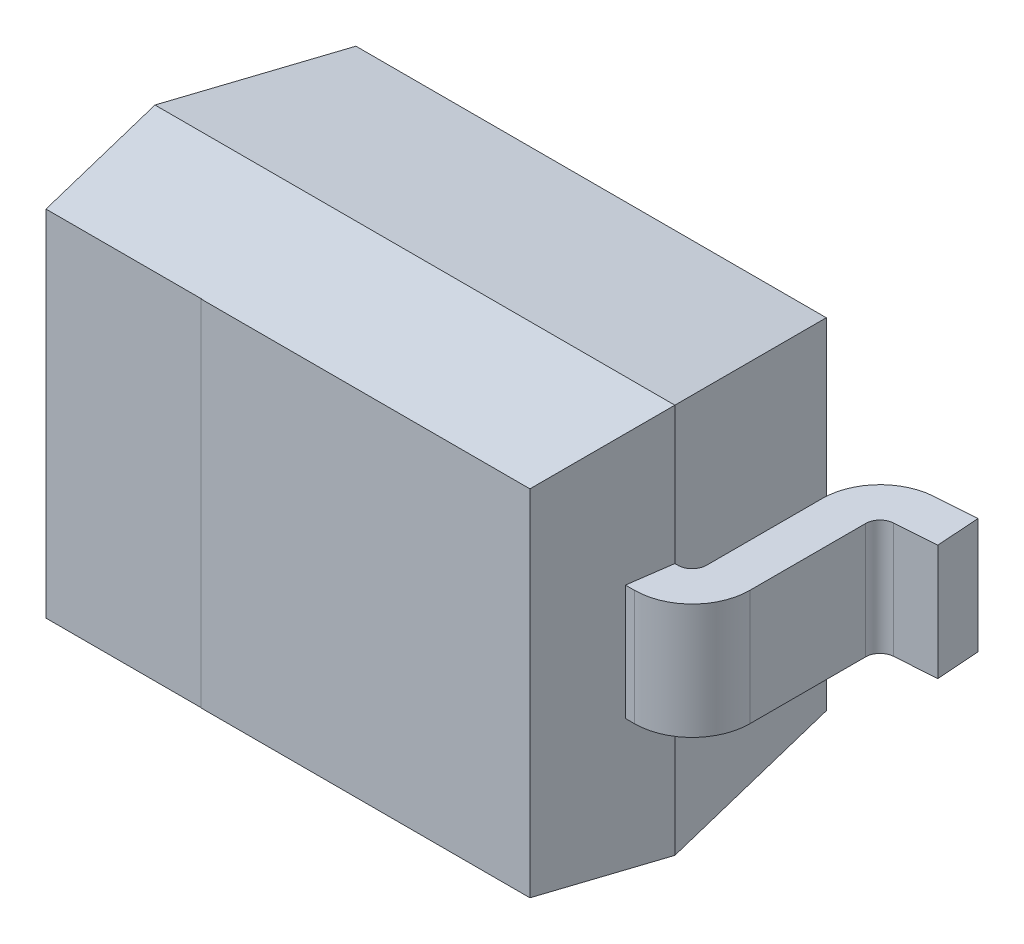
ISO-10303-21;
HEADER;
FILE_DESCRIPTION(('STEP AP214'),'2;1');
FILE_NAME('part.step','',(''),(''),'','','');
FILE_SCHEMA(('AUTOMOTIVE_DESIGN { 1 0 10303 214 1 1 1 1 }'));
ENDSEC;
DATA;
#1=APPLICATION_CONTEXT('core data for automotive mechanical design processes');
#2=APPLICATION_PROTOCOL_DEFINITION('international standard','automotive_design',2000,#1);
#3=PRODUCT_CONTEXT('',#1,'mechanical');
#4=PRODUCT('Part','Part','',(#3));
#5=PRODUCT_RELATED_PRODUCT_CATEGORY('part','',(#4));
#6=PRODUCT_DEFINITION_FORMATION('','',#4);
#7=PRODUCT_DEFINITION_CONTEXT('part definition',#1,'design');
#8=PRODUCT_DEFINITION('design','',#6,#7);
#9=PRODUCT_DEFINITION_SHAPE('','',#8);
#10=(LENGTH_UNIT() NAMED_UNIT(*) SI_UNIT(.MILLI.,.METRE.));
#11=(NAMED_UNIT(*) PLANE_ANGLE_UNIT() SI_UNIT($,.RADIAN.));
#12=(NAMED_UNIT(*) SI_UNIT($,.STERADIAN.) SOLID_ANGLE_UNIT());
#13=UNCERTAINTY_MEASURE_WITH_UNIT(LENGTH_MEASURE(1.E-05),#10,'distance_accuracy_value','');
#14=(GEOMETRIC_REPRESENTATION_CONTEXT(3) GLOBAL_UNCERTAINTY_ASSIGNED_CONTEXT((#13)) GLOBAL_UNIT_ASSIGNED_CONTEXT((#10,
#11,#12)) REPRESENTATION_CONTEXT('',''));
#15=CARTESIAN_POINT('',(0.,0.,0.));
#16=DIRECTION('',(0.,0.,1.));
#17=DIRECTION('',(1.,0.,0.));
#18=AXIS2_PLACEMENT_3D('',#15,#16,#17);
#19=CARTESIAN_POINT('',(0.838162032731,2.5,1.1));
#20=DIRECTION('',(-0.990268068741588,0.,-0.139173100959942));
#21=DIRECTION('',(-0.139173100959942,0.,0.990268068741588));
#22=AXIS2_PLACEMENT_3D('',#19,#20,#21);
#23=PLANE('',#22);
#24=DIRECTION('',(0.139173100959942,0.,-0.990268068741588));
#25=VECTOR('',#24,1.);
#26=CARTESIAN_POINT('',(0.878918874795,0.2,0.81));
#27=LINE('',#26,#25);
#28=CARTESIAN_POINT('',(0.878918874795,0.2,0.81));
#29=VERTEX_POINT('',#28);
#30=CARTESIAN_POINT('',(0.9,0.2,0.66));
#31=VERTEX_POINT('',#30);
#32=EDGE_CURVE('E11',#29,#31,#27,.T.);
#33=ORIENTED_EDGE('',*,*,#32,.T.);
#34=DIRECTION('',(0.,-1.,0.));
#35=VECTOR('',#34,1.);
#36=CARTESIAN_POINT('',(0.9,2.5,0.66));
#37=LINE('',#36,#35);
#38=CARTESIAN_POINT('',(0.9,0.675,0.66));
#39=VERTEX_POINT('',#38);
#40=EDGE_CURVE('E25',#39,#31,#37,.T.);
#41=ORIENTED_EDGE('',*,*,#40,.F.);
#42=DIRECTION('',(0.137844537491984,0.137844537491984,-0.980814848463889));
#43=VECTOR('',#42,1.);
#44=CARTESIAN_POINT('',(0.874014060794,0.649014060794,0.844899565031));
#45=LINE('',#44,#43);
#46=CARTESIAN_POINT('',(0.838162032731,0.613162032731,1.1));
#47=VERTEX_POINT('',#46);
#48=EDGE_CURVE('E689',#47,#39,#45,.T.);
#49=ORIENTED_EDGE('',*,*,#48,.F.);
#50=DIRECTION('',(0.,-1.,0.));
#51=VECTOR('',#50,1.);
#52=CARTESIAN_POINT('',(0.838162032731,2.5,1.1));
#53=LINE('',#52,#51);
#54=CARTESIAN_POINT('',(0.838162032731,-0.613162032731,1.1));
#55=VERTEX_POINT('',#54);
#56=EDGE_CURVE('E685',#47,#55,#53,.T.);
#57=ORIENTED_EDGE('',*,*,#56,.T.);
#58=DIRECTION('',(-0.137844537491984,0.137844537491984,0.980814848463889));
#59=VECTOR('',#58,1.);
#60=CARTESIAN_POINT('',(0.779008478213,-0.554008478213,1.520899410789));
#61=LINE('',#60,#59);
#62=CARTESIAN_POINT('',(0.9,-0.675,0.66));
#63=VERTEX_POINT('',#62);
#64=EDGE_CURVE('E240',#63,#55,#61,.T.);
#65=ORIENTED_EDGE('',*,*,#64,.F.);
#66=DIRECTION('',(0.,-1.,0.));
#67=VECTOR('',#66,1.);
#68=CARTESIAN_POINT('',(0.9,2.5,0.66));
#69=LINE('',#68,#67);
#70=CARTESIAN_POINT('',(0.9,-0.2,0.66));
#71=VERTEX_POINT('',#70);
#72=EDGE_CURVE('E677',#71,#63,#69,.T.);
#73=ORIENTED_EDGE('',*,*,#72,.F.);
#74=DIRECTION('',(0.139173100959942,0.,-0.990268068741588));
#75=VECTOR('',#74,1.);
#76=CARTESIAN_POINT('',(0.878918874795,-0.2,0.81));
#77=LINE('',#76,#75);
#78=CARTESIAN_POINT('',(0.878918874795,-0.2,0.81));
#79=VERTEX_POINT('',#78);
#80=EDGE_CURVE('E672',#79,#71,#77,.T.);
#81=ORIENTED_EDGE('',*,*,#80,.F.);
#82=DIRECTION('',(0.,-1.,0.));
#83=VECTOR('',#82,1.);
#84=CARTESIAN_POINT('',(0.878918874795,0.2,0.81));
#85=LINE('',#84,#83);
#86=EDGE_CURVE('E667',#29,#79,#85,.T.);
#87=ORIENTED_EDGE('',*,*,#86,.F.);
#88=EDGE_LOOP('',(#33,#41,#49,#57,#65,#73,#81,#87));
#89=FACE_BOUND('',#88,.T.);
#90=ADVANCED_FACE('F17',(#89),#23,.F.);
#91=CARTESIAN_POINT('',(0.91,0.2,0.81));
#92=DIRECTION('',(0.,0.,1.));
#93=DIRECTION('',(1.,0.,0.));
#94=AXIS2_PLACEMENT_3D('',#91,#92,#93);
#95=PLANE('',#94);
#96=DIRECTION('',(-1.,0.,0.));
#97=VECTOR('',#96,1.);
#98=CARTESIAN_POINT('',(0.91,-0.2,0.81));
#99=LINE('',#98,#97);
#100=CARTESIAN_POINT('',(0.91,-0.2,0.81));
#101=VERTEX_POINT('',#100);
#102=EDGE_CURVE('E662',#101,#79,#99,.T.);
#103=ORIENTED_EDGE('',*,*,#102,.F.);
#104=DIRECTION('',(0.,-1.,0.));
#105=VECTOR('',#104,1.);
#106=CARTESIAN_POINT('',(0.91,0.2,0.81));
#107=LINE('',#106,#105);
#108=CARTESIAN_POINT('',(0.91,0.2,0.81));
#109=VERTEX_POINT('',#108);
#110=EDGE_CURVE('E657',#109,#101,#107,.T.);
#111=ORIENTED_EDGE('',*,*,#110,.F.);
#112=DIRECTION('',(-1.,0.,0.));
#113=VECTOR('',#112,1.);
#114=CARTESIAN_POINT('',(0.91,0.2,0.81));
#115=LINE('',#114,#113);
#116=EDGE_CURVE('E652',#109,#29,#115,.T.);
#117=ORIENTED_EDGE('',*,*,#116,.T.);
#118=ORIENTED_EDGE('',*,*,#86,.T.);
#119=EDGE_LOOP('',(#103,#111,#117,#118));
#120=FACE_BOUND('',#119,.T.);
#121=ADVANCED_FACE('F735',(#120),#95,.T.);
#122=CARTESIAN_POINT('',(0.91,0.2,0.61));
#123=DIRECTION('',(0.,-1.,0.));
#124=DIRECTION('',(0.,0.,-1.));
#125=AXIS2_PLACEMENT_3D('',#122,#123,#124);
#126=PLANE('',#125);
#127=ORIENTED_EDGE('',*,*,#116,.F.);
#128=CARTESIAN_POINT('',(0.91,0.2,0.61));
#129=DIRECTION('',(0.,-1.,0.));
#130=DIRECTION('',(0.,0.,1.));
#131=AXIS2_PLACEMENT_3D('',#128,#129,#130);
#132=CIRCLE('',#131,0.2);
#133=CARTESIAN_POINT('',(1.11,0.2,0.61));
#134=VERTEX_POINT('',#133);
#135=EDGE_CURVE('E647',#134,#109,#132,.T.);
#136=ORIENTED_EDGE('',*,*,#135,.F.);
#137=DIRECTION('',(0.,0.,1.));
#138=VECTOR('',#137,1.);
#139=CARTESIAN_POINT('',(1.11,0.2,0.209546456115));
#140=LINE('',#139,#138);
#141=CARTESIAN_POINT('',(1.11,0.2,0.209546456115));
#142=VERTEX_POINT('',#141);
#143=EDGE_CURVE('E642',#142,#134,#140,.T.);
#144=ORIENTED_EDGE('',*,*,#143,.F.);
#145=CARTESIAN_POINT('',(1.16,0.2,0.209546456115));
#146=DIRECTION('',(0.,1.,0.));
#147=DIRECTION('',(0.,0.,-1.));
#148=AXIS2_PLACEMENT_3D('',#145,#146,#147);
#149=CIRCLE('',#148,0.05);
#150=CARTESIAN_POINT('',(1.156512176313,0.2,0.159668253602));
#151=VERTEX_POINT('',#150);
#152=EDGE_CURVE('E637',#151,#142,#149,.T.);
#153=ORIENTED_EDGE('',*,*,#152,.F.);
#154=DIRECTION('',(-0.997564050259825,0.,0.0697564737441078));
#155=VECTOR('',#154,1.);
#156=CARTESIAN_POINT('',(1.3,0.2,0.149634607539));
#157=LINE('',#156,#155);
#158=CARTESIAN_POINT('',(1.3,0.2,0.149634607539));
#159=VERTEX_POINT('',#158);
#160=EDGE_CURVE('E632',#159,#151,#157,.T.);
#161=ORIENTED_EDGE('',*,*,#160,.F.);
#162=DIRECTION('',(0.0697564737441078,0.,0.997564050259825));
#163=VECTOR('',#162,1.);
#164=CARTESIAN_POINT('',(1.289536528938,0.2,0.));
#165=LINE('',#164,#163);
#166=CARTESIAN_POINT('',(1.289536528938,0.2,0.));
#167=VERTEX_POINT('',#166);
#168=EDGE_CURVE('E627',#167,#159,#165,.T.);
#169=ORIENTED_EDGE('',*,*,#168,.F.);
#170=DIRECTION('',(0.997564050259825,0.,-0.0697564737441078));
#171=VECTOR('',#170,1.);
#172=CARTESIAN_POINT('',(1.146048705251,0.2,0.01003364606316));
#173=LINE('',#172,#171);
#174=CARTESIAN_POINT('',(1.146048705251,0.2,0.01003364606316));
#175=VERTEX_POINT('',#174);
#176=EDGE_CURVE('E622',#175,#167,#173,.T.);
#177=ORIENTED_EDGE('',*,*,#176,.F.);
#178=CARTESIAN_POINT('',(1.16,0.2,0.209546456115));
#179=DIRECTION('',(0.,-1.,0.));
#180=DIRECTION('',(0.,0.,1.));
#181=AXIS2_PLACEMENT_3D('',#178,#179,#180);
#182=CIRCLE('',#181,0.2);
#183=CARTESIAN_POINT('',(0.96,0.2,0.209546456115));
#184=VERTEX_POINT('',#183);
#185=EDGE_CURVE('E617',#184,#175,#182,.T.);
#186=ORIENTED_EDGE('',*,*,#185,.F.);
#187=DIRECTION('',(0.,0.,-1.));
#188=VECTOR('',#187,1.);
#189=CARTESIAN_POINT('',(0.96,0.2,0.61));
#190=LINE('',#189,#188);
#191=CARTESIAN_POINT('',(0.96,0.2,0.61));
#192=VERTEX_POINT('',#191);
#193=EDGE_CURVE('E612',#192,#184,#190,.T.);
#194=ORIENTED_EDGE('',*,*,#193,.F.);
#195=CARTESIAN_POINT('',(0.91,0.2,0.61));
#196=DIRECTION('',(0.,1.,0.));
#197=DIRECTION('',(0.,0.,-1.));
#198=AXIS2_PLACEMENT_3D('',#195,#196,#197);
#199=CIRCLE('',#198,0.05);
#200=CARTESIAN_POINT('',(0.91,0.2,0.66));
#201=VERTEX_POINT('',#200);
#202=EDGE_CURVE('E607',#201,#192,#199,.T.);
#203=ORIENTED_EDGE('',*,*,#202,.F.);
#204=DIRECTION('',(1.,0.,0.));
#205=VECTOR('',#204,1.);
#206=CARTESIAN_POINT('',(0.9,0.2,0.66));
#207=LINE('',#206,#205);
#208=EDGE_CURVE('E602',#31,#201,#207,.T.);
#209=ORIENTED_EDGE('',*,*,#208,.F.);
#210=ORIENTED_EDGE('',*,*,#32,.F.);
#211=EDGE_LOOP('',(#127,#136,#144,#153,#161,#169,#177,#186,#194,#203,#209,#210));
#212=FACE_BOUND('',#211,.T.);
#213=ADVANCED_FACE('F740',(#212),#126,.F.);
#214=CARTESIAN_POINT('',(0.9,0.2,0.66));
#215=DIRECTION('',(0.,0.,-1.));
#216=DIRECTION('',(-1.,0.,0.));
#217=AXIS2_PLACEMENT_3D('',#214,#215,#216);
#218=PLANE('',#217);
#219=DIRECTION('',(1.,0.,0.));
#220=VECTOR('',#219,1.);
#221=CARTESIAN_POINT('',(0.9,-0.2,0.66));
#222=LINE('',#221,#220);
#223=CARTESIAN_POINT('',(0.91,-0.2,0.66));
#224=VERTEX_POINT('',#223);
#225=EDGE_CURVE('E597',#71,#224,#222,.T.);
#226=ORIENTED_EDGE('',*,*,#225,.F.);
#227=DIRECTION('',(0.,-1.,0.));
#228=VECTOR('',#227,1.);
#229=CARTESIAN_POINT('',(0.9,0.2,0.66));
#230=LINE('',#229,#228);
#231=EDGE_CURVE('E592',#31,#71,#230,.T.);
#232=ORIENTED_EDGE('',*,*,#231,.F.);
#233=ORIENTED_EDGE('',*,*,#208,.T.);
#234=DIRECTION('',(0.,-1.,0.));
#235=VECTOR('',#234,1.);
#236=CARTESIAN_POINT('',(0.91,0.2,0.66));
#237=LINE('',#236,#235);
#238=EDGE_CURVE('E588',#201,#224,#237,.T.);
#239=ORIENTED_EDGE('',*,*,#238,.T.);
#240=EDGE_LOOP('',(#226,#232,#233,#239));
#241=FACE_BOUND('',#240,.T.);
#242=ADVANCED_FACE('F747',(#241),#218,.T.);
#243=CARTESIAN_POINT('',(0.91,0.2,0.61));
#244=DIRECTION('',(0.,-1.,0.));
#245=DIRECTION('',(-0.707106781186548,0.,-0.707106781186548));
#246=AXIS2_PLACEMENT_3D('',#243,#244,#245);
#247=CYLINDRICAL_SURFACE('',#246,0.05);
#248=CARTESIAN_POINT('',(0.91,-0.2,0.61));
#249=DIRECTION('',(0.,1.,0.));
#250=DIRECTION('',(0.,0.,-1.));
#251=AXIS2_PLACEMENT_3D('',#248,#249,#250);
#252=CIRCLE('',#251,0.05);
#253=CARTESIAN_POINT('',(0.96,-0.2,0.61));
#254=VERTEX_POINT('',#253);
#255=EDGE_CURVE('E583',#224,#254,#252,.T.);
#256=ORIENTED_EDGE('',*,*,#255,.F.);
#257=ORIENTED_EDGE('',*,*,#238,.F.);
#258=ORIENTED_EDGE('',*,*,#202,.T.);
#259=DIRECTION('',(0.,-1.,0.));
#260=VECTOR('',#259,1.);
#261=CARTESIAN_POINT('',(0.96,0.2,0.61));
#262=LINE('',#261,#260);
#263=EDGE_CURVE('E579',#192,#254,#262,.T.);
#264=ORIENTED_EDGE('',*,*,#263,.T.);
#265=EDGE_LOOP('',(#256,#257,#258,#264));
#266=FACE_BOUND('',#265,.T.);
#267=ADVANCED_FACE('F753',(#266),#247,.F.);
#268=CARTESIAN_POINT('',(0.96,0.2,0.61));
#269=DIRECTION('',(-1.,0.,0.));
#270=DIRECTION('',(0.,0.,1.));
#271=AXIS2_PLACEMENT_3D('',#268,#269,#270);
#272=PLANE('',#271);
#273=DIRECTION('',(0.,0.,-1.));
#274=VECTOR('',#273,1.);
#275=CARTESIAN_POINT('',(0.96,-0.2,0.61));
#276=LINE('',#275,#274);
#277=CARTESIAN_POINT('',(0.96,-0.2,0.209546456115));
#278=VERTEX_POINT('',#277);
#279=EDGE_CURVE('E574',#254,#278,#276,.T.);
#280=ORIENTED_EDGE('',*,*,#279,.F.);
#281=ORIENTED_EDGE('',*,*,#263,.F.);
#282=ORIENTED_EDGE('',*,*,#193,.T.);
#283=DIRECTION('',(0.,-1.,0.));
#284=VECTOR('',#283,1.);
#285=CARTESIAN_POINT('',(0.96,0.2,0.209546456115));
#286=LINE('',#285,#284);
#287=EDGE_CURVE('E570',#184,#278,#286,.T.);
#288=ORIENTED_EDGE('',*,*,#287,.T.);
#289=EDGE_LOOP('',(#280,#281,#282,#288));
#290=FACE_BOUND('',#289,.T.);
#291=ADVANCED_FACE('F757',(#290),#272,.T.);
#292=CARTESIAN_POINT('',(1.16,0.2,0.209546456115));
#293=DIRECTION('',(0.,-1.,0.));
#294=DIRECTION('',(0.731353701619483,0.,0.681998360062164));
#295=AXIS2_PLACEMENT_3D('',#292,#293,#294);
#296=CYLINDRICAL_SURFACE('',#295,0.2);
#297=CARTESIAN_POINT('',(1.16,-0.2,0.209546456115));
#298=DIRECTION('',(0.,-1.,0.));
#299=DIRECTION('',(0.,0.,1.));
#300=AXIS2_PLACEMENT_3D('',#297,#298,#299);
#301=CIRCLE('',#300,0.2);
#302=CARTESIAN_POINT('',(1.146048705251,-0.2,0.01003364606316));
#303=VERTEX_POINT('',#302);
#304=EDGE_CURVE('E565',#278,#303,#301,.T.);
#305=ORIENTED_EDGE('',*,*,#304,.F.);
#306=ORIENTED_EDGE('',*,*,#287,.F.);
#307=ORIENTED_EDGE('',*,*,#185,.T.);
#308=DIRECTION('',(0.,-1.,0.));
#309=VECTOR('',#308,1.);
#310=CARTESIAN_POINT('',(1.146048705251,0.2,0.01003364606316));
#311=LINE('',#310,#309);
#312=EDGE_CURVE('E561',#175,#303,#311,.T.);
#313=ORIENTED_EDGE('',*,*,#312,.T.);
#314=EDGE_LOOP('',(#305,#306,#307,#313));
#315=FACE_BOUND('',#314,.T.);
#316=ADVANCED_FACE('F761',(#315),#296,.T.);
#317=CARTESIAN_POINT('',(1.146048705251,0.2,0.01003364606316));
#318=DIRECTION('',(-0.0697564737441078,0.,-0.997564050259826));
#319=DIRECTION('',(-0.997564050259826,0.,0.0697564737441078));
#320=AXIS2_PLACEMENT_3D('',#317,#318,#319);
#321=PLANE('',#320);
#322=DIRECTION('',(0.997564050259825,0.,-0.0697564737441078));
#323=VECTOR('',#322,1.);
#324=CARTESIAN_POINT('',(1.146048705251,-0.2,0.01003364606316));
#325=LINE('',#324,#323);
#326=CARTESIAN_POINT('',(1.289536528938,-0.2,0.));
#327=VERTEX_POINT('',#326);
#328=EDGE_CURVE('E556',#303,#327,#325,.T.);
#329=ORIENTED_EDGE('',*,*,#328,.F.);
#330=ORIENTED_EDGE('',*,*,#312,.F.);
#331=ORIENTED_EDGE('',*,*,#176,.T.);
#332=DIRECTION('',(0.,-1.,0.));
#333=VECTOR('',#332,1.);
#334=CARTESIAN_POINT('',(1.289536528938,0.2,0.));
#335=LINE('',#334,#333);
#336=EDGE_CURVE('E552',#167,#327,#335,.T.);
#337=ORIENTED_EDGE('',*,*,#336,.T.);
#338=EDGE_LOOP('',(#329,#330,#331,#337));
#339=FACE_BOUND('',#338,.T.);
#340=ADVANCED_FACE('F765',(#339),#321,.T.);
#341=CARTESIAN_POINT('',(1.289536528938,0.2,0.));
#342=DIRECTION('',(0.997564050259826,0.,-0.0697564737441078));
#343=DIRECTION('',(-0.0697564737441078,0.,-0.997564050259826));
#344=AXIS2_PLACEMENT_3D('',#341,#342,#343);
#345=PLANE('',#344);
#346=DIRECTION('',(0.0697564737441078,0.,0.997564050259825));
#347=VECTOR('',#346,1.);
#348=CARTESIAN_POINT('',(1.289536528938,-0.2,0.));
#349=LINE('',#348,#347);
#350=CARTESIAN_POINT('',(1.3,-0.2,0.149634607539));
#351=VERTEX_POINT('',#350);
#352=EDGE_CURVE('E547',#327,#351,#349,.T.);
#353=ORIENTED_EDGE('',*,*,#352,.F.);
#354=ORIENTED_EDGE('',*,*,#336,.F.);
#355=ORIENTED_EDGE('',*,*,#168,.T.);
#356=DIRECTION('',(0.,-1.,0.));
#357=VECTOR('',#356,1.);
#358=CARTESIAN_POINT('',(1.3,0.2,0.149634607539));
#359=LINE('',#358,#357);
#360=EDGE_CURVE('E543',#159,#351,#359,.T.);
#361=ORIENTED_EDGE('',*,*,#360,.T.);
#362=EDGE_LOOP('',(#353,#354,#355,#361));
#363=FACE_BOUND('',#362,.T.);
#364=ADVANCED_FACE('F769',(#363),#345,.T.);
#365=CARTESIAN_POINT('',(1.3,0.2,0.149634607539));
#366=DIRECTION('',(0.0697564737441078,0.,0.997564050259826));
#367=DIRECTION('',(0.997564050259826,0.,-0.0697564737441078));
#368=AXIS2_PLACEMENT_3D('',#365,#366,#367);
#369=PLANE('',#368);
#370=DIRECTION('',(-0.997564050259825,0.,0.0697564737441078));
#371=VECTOR('',#370,1.);
#372=CARTESIAN_POINT('',(1.3,-0.2,0.149634607539));
#373=LINE('',#372,#371);
#374=CARTESIAN_POINT('',(1.156512176313,-0.2,0.159668253602));
#375=VERTEX_POINT('',#374);
#376=EDGE_CURVE('E538',#351,#375,#373,.T.);
#377=ORIENTED_EDGE('',*,*,#376,.F.);
#378=ORIENTED_EDGE('',*,*,#360,.F.);
#379=ORIENTED_EDGE('',*,*,#160,.T.);
#380=DIRECTION('',(0.,-1.,0.));
#381=VECTOR('',#380,1.);
#382=CARTESIAN_POINT('',(1.156512176313,0.2,0.159668253602));
#383=LINE('',#382,#381);
#384=EDGE_CURVE('E534',#151,#375,#383,.T.);
#385=ORIENTED_EDGE('',*,*,#384,.T.);
#386=EDGE_LOOP('',(#377,#378,#379,#385));
#387=FACE_BOUND('',#386,.T.);
#388=ADVANCED_FACE('F773',(#387),#369,.T.);
#389=CARTESIAN_POINT('',(1.16,0.2,0.209546456115));
#390=DIRECTION('',(0.,-1.,0.));
#391=DIRECTION('',(0.731353701617763,0.,0.681998360064008));
#392=AXIS2_PLACEMENT_3D('',#389,#390,#391);
#393=CYLINDRICAL_SURFACE('',#392,0.05);
#394=CARTESIAN_POINT('',(1.16,-0.2,0.209546456115));
#395=DIRECTION('',(0.,1.,0.));
#396=DIRECTION('',(0.,0.,-1.));
#397=AXIS2_PLACEMENT_3D('',#394,#395,#396);
#398=CIRCLE('',#397,0.05);
#399=CARTESIAN_POINT('',(1.11,-0.2,0.209546456115));
#400=VERTEX_POINT('',#399);
#401=EDGE_CURVE('E529',#375,#400,#398,.T.);
#402=ORIENTED_EDGE('',*,*,#401,.F.);
#403=ORIENTED_EDGE('',*,*,#384,.F.);
#404=ORIENTED_EDGE('',*,*,#152,.T.);
#405=DIRECTION('',(0.,-1.,0.));
#406=VECTOR('',#405,1.);
#407=CARTESIAN_POINT('',(1.11,0.2,0.209546456115));
#408=LINE('',#407,#406);
#409=EDGE_CURVE('E525',#142,#400,#408,.T.);
#410=ORIENTED_EDGE('',*,*,#409,.T.);
#411=EDGE_LOOP('',(#402,#403,#404,#410));
#412=FACE_BOUND('',#411,.T.);
#413=ADVANCED_FACE('F777',(#412),#393,.F.);
#414=CARTESIAN_POINT('',(1.11,0.2,0.209546456115));
#415=DIRECTION('',(1.,0.,0.));
#416=DIRECTION('',(0.,0.,-1.));
#417=AXIS2_PLACEMENT_3D('',#414,#415,#416);
#418=PLANE('',#417);
#419=DIRECTION('',(0.,0.,1.));
#420=VECTOR('',#419,1.);
#421=CARTESIAN_POINT('',(1.11,-0.2,0.209546456115));
#422=LINE('',#421,#420);
#423=CARTESIAN_POINT('',(1.11,-0.2,0.61));
#424=VERTEX_POINT('',#423);
#425=EDGE_CURVE('E520',#400,#424,#422,.T.);
#426=ORIENTED_EDGE('',*,*,#425,.F.);
#427=ORIENTED_EDGE('',*,*,#409,.F.);
#428=ORIENTED_EDGE('',*,*,#143,.T.);
#429=DIRECTION('',(0.,-1.,0.));
#430=VECTOR('',#429,1.);
#431=CARTESIAN_POINT('',(1.11,0.2,0.61));
#432=LINE('',#431,#430);
#433=EDGE_CURVE('E516',#134,#424,#432,.T.);
#434=ORIENTED_EDGE('',*,*,#433,.T.);
#435=EDGE_LOOP('',(#426,#427,#428,#434));
#436=FACE_BOUND('',#435,.T.);
#437=ADVANCED_FACE('F781',(#436),#418,.T.);
#438=CARTESIAN_POINT('',(0.91,0.2,0.61));
#439=DIRECTION('',(0.,-1.,0.));
#440=DIRECTION('',(-0.707106781186548,0.,-0.707106781186548));
#441=AXIS2_PLACEMENT_3D('',#438,#439,#440);
#442=CYLINDRICAL_SURFACE('',#441,0.2);
#443=CARTESIAN_POINT('',(0.91,-0.2,0.61));
#444=DIRECTION('',(0.,-1.,0.));
#445=DIRECTION('',(0.,0.,1.));
#446=AXIS2_PLACEMENT_3D('',#443,#444,#445);
#447=CIRCLE('',#446,0.2);
#448=EDGE_CURVE('E511',#424,#101,#447,.T.);
#449=ORIENTED_EDGE('',*,*,#448,.F.);
#450=ORIENTED_EDGE('',*,*,#433,.F.);
#451=ORIENTED_EDGE('',*,*,#135,.T.);
#452=ORIENTED_EDGE('',*,*,#110,.T.);
#453=EDGE_LOOP('',(#449,#450,#451,#452));
#454=FACE_BOUND('',#453,.T.);
#455=ADVANCED_FACE('F785',(#454),#442,.T.);
#456=CARTESIAN_POINT('',(0.91,-0.2,0.61));
#457=DIRECTION('',(0.,-1.,0.));
#458=DIRECTION('',(0.,0.,-1.));
#459=AXIS2_PLACEMENT_3D('',#456,#457,#458);
#460=PLANE('',#459);
#461=ORIENTED_EDGE('',*,*,#102,.T.);
#462=ORIENTED_EDGE('',*,*,#80,.T.);
#463=ORIENTED_EDGE('',*,*,#225,.T.);
#464=ORIENTED_EDGE('',*,*,#255,.T.);
#465=ORIENTED_EDGE('',*,*,#279,.T.);
#466=ORIENTED_EDGE('',*,*,#304,.T.);
#467=ORIENTED_EDGE('',*,*,#328,.T.);
#468=ORIENTED_EDGE('',*,*,#352,.T.);
#469=ORIENTED_EDGE('',*,*,#376,.T.);
#470=ORIENTED_EDGE('',*,*,#401,.T.);
#471=ORIENTED_EDGE('',*,*,#425,.T.);
#472=ORIENTED_EDGE('',*,*,#448,.T.);
#473=EDGE_LOOP('',(#461,#462,#463,#464,#465,#466,#467,#468,#469,#470,#471,#472));
#474=FACE_BOUND('',#473,.T.);
#475=ADVANCED_FACE('F789',(#474),#460,.T.);
#476=CARTESIAN_POINT('',(0.9,2.5,0.66));
#477=DIRECTION('',(-0.990268068741588,0.,0.139173100959942));
#478=DIRECTION('',(0.139173100959942,0.,0.990268068741588));
#479=AXIS2_PLACEMENT_3D('',#476,#477,#478);
#480=PLANE('',#479);
#481=DIRECTION('',(0.137844537491984,-0.137844537491984,0.980814848463889));
#482=VECTOR('',#481,1.);
#483=CARTESIAN_POINT('',(0.839671455061,-0.614671455061,0.230740097944));
#484=LINE('',#483,#482);
#485=CARTESIAN_POINT('',(0.814270090832,-0.589270090832,0.05));
#486=VERTEX_POINT('',#485);
#487=EDGE_CURVE('E506',#486,#63,#484,.T.);
#488=ORIENTED_EDGE('',*,*,#487,.F.);
#489=DIRECTION('',(0.,-1.,0.));
#490=VECTOR('',#489,1.);
#491=CARTESIAN_POINT('',(0.814270090832,2.5,0.05));
#492=LINE('',#491,#490);
#493=CARTESIAN_POINT('',(0.814270090832,0.589270090832,0.05));
#494=VERTEX_POINT('',#493);
#495=EDGE_CURVE('E501',#494,#486,#492,.T.);
#496=ORIENTED_EDGE('',*,*,#495,.F.);
#497=DIRECTION('',(-0.137844537491984,-0.137844537491984,-0.980814848463889));
#498=VECTOR('',#497,1.);
#499=CARTESIAN_POINT('',(0.934677037642,0.709677037642,0.906739943701));
#500=LINE('',#499,#498);
#501=EDGE_CURVE('E496',#39,#494,#500,.T.);
#502=ORIENTED_EDGE('',*,*,#501,.F.);
#503=ORIENTED_EDGE('',*,*,#40,.T.);
#504=ORIENTED_EDGE('',*,*,#231,.T.);
#505=ORIENTED_EDGE('',*,*,#72,.T.);
#506=EDGE_LOOP('',(#488,#496,#502,#503,#504,#505));
#507=FACE_BOUND('',#506,.T.);
#508=ADVANCED_FACE('F699',(#507),#480,.F.);
#509=CARTESIAN_POINT('',(-0.9,0.675,0.66));
#510=DIRECTION('',(0.,0.990268068741588,-0.139173100959942));
#511=DIRECTION('',(0.,0.139173100959942,0.990268068741588));
#512=AXIS2_PLACEMENT_3D('',#509,#510,#511);
#513=PLANE('',#512);
#514=DIRECTION('',(-0.137844537491984,0.137844537491984,0.980814848463889));
#515=VECTOR('',#514,1.);
#516=CARTESIAN_POINT('',(-0.850576092467,0.625576092467,0.308330624776));
#517=LINE('',#516,#515);
#518=CARTESIAN_POINT('',(-0.814270090832,0.589270090832,0.05));
#519=VERTEX_POINT('',#518);
#520=CARTESIAN_POINT('',(-0.9,0.675,0.66));
#521=VERTEX_POINT('',#520);
#522=EDGE_CURVE('E492',#519,#521,#517,.T.);
#523=ORIENTED_EDGE('',*,*,#522,.T.);
#524=DIRECTION('',(1.,0.,0.));
#525=VECTOR('',#524,1.);
#526=CARTESIAN_POINT('',(-0.9,0.675,0.66));
#527=LINE('',#526,#525);
#528=EDGE_CURVE('E487',#521,#39,#527,.T.);
#529=ORIENTED_EDGE('',*,*,#528,.T.);
#530=ORIENTED_EDGE('',*,*,#501,.T.);
#531=DIRECTION('',(1.,0.,0.));
#532=VECTOR('',#531,1.);
#533=CARTESIAN_POINT('',(-0.9,0.589270090832,0.05));
#534=LINE('',#533,#532);
#535=EDGE_CURVE('E482',#519,#494,#534,.T.);
#536=ORIENTED_EDGE('',*,*,#535,.F.);
#537=EDGE_LOOP('',(#523,#529,#530,#536));
#538=FACE_BOUND('',#537,.T.);
#539=ADVANCED_FACE('F702',(#538),#513,.T.);
#540=CARTESIAN_POINT('',(0.814270090832,2.5,0.05));
#541=DIRECTION('',(0.,0.,1.));
#542=DIRECTION('',(1.,0.,0.));
#543=AXIS2_PLACEMENT_3D('',#540,#541,#542);
#544=PLANE('',#543);
#545=DIRECTION('',(1.,0.,0.));
#546=VECTOR('',#545,1.);
#547=CARTESIAN_POINT('',(-0.9,-0.589270090832,0.05));
#548=LINE('',#547,#546);
#549=CARTESIAN_POINT('',(-0.814270090832,-0.589270090832,0.05));
#550=VERTEX_POINT('',#549);
#551=EDGE_CURVE('E477',#550,#486,#548,.T.);
#552=ORIENTED_EDGE('',*,*,#551,.F.);
#553=DIRECTION('',(0.,-1.,0.));
#554=VECTOR('',#553,1.);
#555=CARTESIAN_POINT('',(-0.814270090832,2.5,0.05));
#556=LINE('',#555,#554);
#557=EDGE_CURVE('E472',#519,#550,#556,.T.);
#558=ORIENTED_EDGE('',*,*,#557,.F.);
#559=ORIENTED_EDGE('',*,*,#535,.T.);
#560=ORIENTED_EDGE('',*,*,#495,.T.);
#561=EDGE_LOOP('',(#552,#558,#559,#560));
#562=FACE_BOUND('',#561,.T.);
#563=ADVANCED_FACE('F714',(#562),#544,.F.);
#564=CARTESIAN_POINT('',(-0.814270090832,2.5,0.05));
#565=DIRECTION('',(0.990268068741588,0.,0.139173100959942));
#566=DIRECTION('',(0.139173100959942,0.,-0.990268068741588));
#567=AXIS2_PLACEMENT_3D('',#564,#565,#566);
#568=PLANE('',#567);
#569=DIRECTION('',(0.137844537491984,0.137844537491984,-0.980814848463889));
#570=VECTOR('',#569,1.);
#571=CARTESIAN_POINT('',(-0.755570509885,-0.530570509885,-0.367669220981));
#572=LINE('',#571,#570);
#573=CARTESIAN_POINT('',(-0.9,-0.675,0.66));
#574=VERTEX_POINT('',#573);
#575=EDGE_CURVE('E467',#574,#550,#572,.T.);
#576=ORIENTED_EDGE('',*,*,#575,.F.);
#577=DIRECTION('',(0.,-1.,0.));
#578=VECTOR('',#577,1.);
#579=CARTESIAN_POINT('',(-0.9,2.5,0.66));
#580=LINE('',#579,#578);
#581=CARTESIAN_POINT('',(-0.9,-0.2,0.66));
#582=VERTEX_POINT('',#581);
#583=EDGE_CURVE('E462',#582,#574,#580,.T.);
#584=ORIENTED_EDGE('',*,*,#583,.F.);
#585=DIRECTION('',(0.,-1.,0.));
#586=VECTOR('',#585,1.);
#587=CARTESIAN_POINT('',(-0.9,0.2,0.66));
#588=LINE('',#587,#586);
#589=CARTESIAN_POINT('',(-0.9,0.2,0.66));
#590=VERTEX_POINT('',#589);
#591=EDGE_CURVE('E457',#590,#582,#588,.T.);
#592=ORIENTED_EDGE('',*,*,#591,.F.);
#593=DIRECTION('',(0.,-1.,0.));
#594=VECTOR('',#593,1.);
#595=CARTESIAN_POINT('',(-0.9,2.5,0.66));
#596=LINE('',#595,#594);
#597=EDGE_CURVE('E452',#521,#590,#596,.T.);
#598=ORIENTED_EDGE('',*,*,#597,.F.);
#599=ORIENTED_EDGE('',*,*,#522,.F.);
#600=ORIENTED_EDGE('',*,*,#557,.T.);
#601=EDGE_LOOP('',(#576,#584,#592,#598,#599,#600));
#602=FACE_BOUND('',#601,.T.);
#603=ADVANCED_FACE('F716',(#602),#568,.F.);
#604=CARTESIAN_POINT('',(-0.9,2.5,0.66));
#605=DIRECTION('',(0.990268068741588,0.,-0.139173100959942));
#606=DIRECTION('',(-0.139173100959942,0.,-0.990268068741588));
#607=AXIS2_PLACEMENT_3D('',#604,#605,#606);
#608=PLANE('',#607);
#609=DIRECTION('',(-0.137844537491984,-0.137844537491984,-0.980814848463889));
#610=VECTOR('',#609,1.);
#611=CARTESIAN_POINT('',(-0.839671455061,-0.614671455061,1.089259902056));
#612=LINE('',#611,#610);
#613=CARTESIAN_POINT('',(-0.838302573566,-0.613302573566,1.099));
#614=VERTEX_POINT('',#613);
#615=EDGE_CURVE('E447',#614,#574,#612,.T.);
#616=ORIENTED_EDGE('',*,*,#615,.F.);
#617=DIRECTION('',(0.,1.,0.));
#618=VECTOR('',#617,1.);
#619=CARTESIAN_POINT('',(-0.838302573566,2.5,1.099));
#620=LINE('',#619,#618);
#621=CARTESIAN_POINT('',(-0.838302573566,0.613302573566,1.099));
#622=VERTEX_POINT('',#621);
#623=EDGE_CURVE('E443',#614,#622,#620,.T.);
#624=ORIENTED_EDGE('',*,*,#623,.T.);
#625=DIRECTION('',(0.137844537491984,-0.137844537491984,0.980814848463889));
#626=VECTOR('',#625,1.);
#627=CARTESIAN_POINT('',(-0.934677037642,0.709677037642,0.413260056299));
#628=LINE('',#627,#626);
#629=EDGE_CURVE('E438',#521,#622,#628,.T.);
#630=ORIENTED_EDGE('',*,*,#629,.F.);
#631=ORIENTED_EDGE('',*,*,#597,.T.);
#632=DIRECTION('',(-0.139173100959942,0.,-0.990268068741588));
#633=VECTOR('',#632,1.);
#634=CARTESIAN_POINT('',(-0.878918874795,0.2,0.81));
#635=LINE('',#634,#633);
#636=CARTESIAN_POINT('',(-0.878918874795,0.2,0.81));
#637=VERTEX_POINT('',#636);
#638=EDGE_CURVE('E433',#637,#590,#635,.T.);
#639=ORIENTED_EDGE('',*,*,#638,.F.);
#640=DIRECTION('',(0.,-1.,0.));
#641=VECTOR('',#640,1.);
#642=CARTESIAN_POINT('',(-0.878918874795,0.2,0.81));
#643=LINE('',#642,#641);
#644=CARTESIAN_POINT('',(-0.878918874795,-0.2,0.81));
#645=VERTEX_POINT('',#644);
#646=EDGE_CURVE('E429',#637,#645,#643,.T.);
#647=ORIENTED_EDGE('',*,*,#646,.T.);
#648=DIRECTION('',(-0.139173100959942,0.,-0.990268068741588));
#649=VECTOR('',#648,1.);
#650=CARTESIAN_POINT('',(-0.878918874795,-0.2,0.81));
#651=LINE('',#650,#649);
#652=EDGE_CURVE('E424',#645,#582,#651,.T.);
#653=ORIENTED_EDGE('',*,*,#652,.T.);
#654=ORIENTED_EDGE('',*,*,#583,.T.);
#655=EDGE_LOOP('',(#616,#624,#630,#631,#639,#647,#653,#654));
#656=FACE_BOUND('',#655,.T.);
#657=ADVANCED_FACE('F720',(#656),#608,.F.);
#658=CARTESIAN_POINT('',(-0.91,-0.2,0.61));
#659=DIRECTION('',(0.,-1.,0.));
#660=DIRECTION('',(0.,0.,-1.));
#661=AXIS2_PLACEMENT_3D('',#658,#659,#660);
#662=PLANE('',#661);
#663=DIRECTION('',(1.,0.,0.));
#664=VECTOR('',#663,1.);
#665=CARTESIAN_POINT('',(-0.91,-0.2,0.81));
#666=LINE('',#665,#664);
#667=CARTESIAN_POINT('',(-0.91,-0.2,0.81));
#668=VERTEX_POINT('',#667);
#669=EDGE_CURVE('E419',#668,#645,#666,.T.);
#670=ORIENTED_EDGE('',*,*,#669,.F.);
#671=CARTESIAN_POINT('',(-0.91,-0.2,0.61));
#672=DIRECTION('',(0.,1.,0.));
#673=DIRECTION('',(0.,0.,1.));
#674=AXIS2_PLACEMENT_3D('',#671,#672,#673);
#675=CIRCLE('',#674,0.2);
#676=CARTESIAN_POINT('',(-1.11,-0.2,0.61));
#677=VERTEX_POINT('',#676);
#678=EDGE_CURVE('E414',#677,#668,#675,.T.);
#679=ORIENTED_EDGE('',*,*,#678,.F.);
#680=DIRECTION('',(0.,0.,1.));
#681=VECTOR('',#680,1.);
#682=CARTESIAN_POINT('',(-1.11,-0.2,0.209546456115));
#683=LINE('',#682,#681);
#684=CARTESIAN_POINT('',(-1.11,-0.2,0.209546456115));
#685=VERTEX_POINT('',#684);
#686=EDGE_CURVE('E409',#685,#677,#683,.T.);
#687=ORIENTED_EDGE('',*,*,#686,.F.);
#688=CARTESIAN_POINT('',(-1.16,-0.2,0.209546456115));
#689=DIRECTION('',(0.,-1.,0.));
#690=DIRECTION('',(0.,0.,-1.));
#691=AXIS2_PLACEMENT_3D('',#688,#689,#690);
#692=CIRCLE('',#691,0.05);
#693=CARTESIAN_POINT('',(-1.156512176313,-0.2,0.159668253602));
#694=VERTEX_POINT('',#693);
#695=EDGE_CURVE('E404',#694,#685,#692,.T.);
#696=ORIENTED_EDGE('',*,*,#695,.F.);
#697=DIRECTION('',(0.997564050259825,0.,0.0697564737441078));
#698=VECTOR('',#697,1.);
#699=CARTESIAN_POINT('',(-1.3,-0.2,0.149634607539));
#700=LINE('',#699,#698);
#701=CARTESIAN_POINT('',(-1.3,-0.2,0.149634607539));
#702=VERTEX_POINT('',#701);
#703=EDGE_CURVE('E399',#702,#694,#700,.T.);
#704=ORIENTED_EDGE('',*,*,#703,.F.);
#705=DIRECTION('',(-0.0697564737441078,0.,0.997564050259825));
#706=VECTOR('',#705,1.);
#707=CARTESIAN_POINT('',(-1.289536528938,-0.2,0.));
#708=LINE('',#707,#706);
#709=CARTESIAN_POINT('',(-1.289536528938,-0.2,0.));
#710=VERTEX_POINT('',#709);
#711=EDGE_CURVE('E394',#710,#702,#708,.T.);
#712=ORIENTED_EDGE('',*,*,#711,.F.);
#713=DIRECTION('',(-0.997564050259825,0.,-0.0697564737441078));
#714=VECTOR('',#713,1.);
#715=CARTESIAN_POINT('',(-1.146048705251,-0.2,0.01003364606316));
#716=LINE('',#715,#714);
#717=CARTESIAN_POINT('',(-1.146048705251,-0.2,0.01003364606316));
#718=VERTEX_POINT('',#717);
#719=EDGE_CURVE('E389',#718,#710,#716,.T.);
#720=ORIENTED_EDGE('',*,*,#719,.F.);
#721=CARTESIAN_POINT('',(-1.16,-0.2,0.209546456115));
#722=DIRECTION('',(0.,1.,0.));
#723=DIRECTION('',(0.,0.,1.));
#724=AXIS2_PLACEMENT_3D('',#721,#722,#723);
#725=CIRCLE('',#724,0.2);
#726=CARTESIAN_POINT('',(-0.96,-0.2,0.209546456115));
#727=VERTEX_POINT('',#726);
#728=EDGE_CURVE('E384',#727,#718,#725,.T.);
#729=ORIENTED_EDGE('',*,*,#728,.F.);
#730=DIRECTION('',(0.,0.,-1.));
#731=VECTOR('',#730,1.);
#732=CARTESIAN_POINT('',(-0.96,-0.2,0.61));
#733=LINE('',#732,#731);
#734=CARTESIAN_POINT('',(-0.96,-0.2,0.61));
#735=VERTEX_POINT('',#734);
#736=EDGE_CURVE('E379',#735,#727,#733,.T.);
#737=ORIENTED_EDGE('',*,*,#736,.F.);
#738=CARTESIAN_POINT('',(-0.91,-0.2,0.61));
#739=DIRECTION('',(0.,-1.,0.));
#740=DIRECTION('',(0.,0.,-1.));
#741=AXIS2_PLACEMENT_3D('',#738,#739,#740);
#742=CIRCLE('',#741,0.05);
#743=CARTESIAN_POINT('',(-0.91,-0.2,0.66));
#744=VERTEX_POINT('',#743);
#745=EDGE_CURVE('E374',#744,#735,#742,.T.);
#746=ORIENTED_EDGE('',*,*,#745,.F.);
#747=DIRECTION('',(-1.,0.,0.));
#748=VECTOR('',#747,1.);
#749=CARTESIAN_POINT('',(-0.9,-0.2,0.66));
#750=LINE('',#749,#748);
#751=EDGE_CURVE('E369',#582,#744,#750,.T.);
#752=ORIENTED_EDGE('',*,*,#751,.F.);
#753=ORIENTED_EDGE('',*,*,#652,.F.);
#754=EDGE_LOOP('',(#670,#679,#687,#696,#704,#712,#720,#729,#737,#746,#752,#753));
#755=FACE_BOUND('',#754,.T.);
#756=ADVANCED_FACE('F803',(#755),#662,.T.);
#757=CARTESIAN_POINT('',(-0.9,0.2,0.66));
#758=DIRECTION('',(0.,0.,1.));
#759=DIRECTION('',(1.,0.,0.));
#760=AXIS2_PLACEMENT_3D('',#757,#758,#759);
#761=PLANE('',#760);
#762=ORIENTED_EDGE('',*,*,#751,.T.);
#763=DIRECTION('',(0.,-1.,0.));
#764=VECTOR('',#763,1.);
#765=CARTESIAN_POINT('',(-0.91,0.2,0.66));
#766=LINE('',#765,#764);
#767=CARTESIAN_POINT('',(-0.91,0.2,0.66));
#768=VERTEX_POINT('',#767);
#769=EDGE_CURVE('E364',#768,#744,#766,.T.);
#770=ORIENTED_EDGE('',*,*,#769,.F.);
#771=DIRECTION('',(-1.,0.,0.));
#772=VECTOR('',#771,1.);
#773=CARTESIAN_POINT('',(-0.9,0.2,0.66));
#774=LINE('',#773,#772);
#775=EDGE_CURVE('E359',#590,#768,#774,.T.);
#776=ORIENTED_EDGE('',*,*,#775,.F.);
#777=ORIENTED_EDGE('',*,*,#591,.T.);
#778=EDGE_LOOP('',(#762,#770,#776,#777));
#779=FACE_BOUND('',#778,.T.);
#780=ADVANCED_FACE('F806',(#779),#761,.F.);
#781=CARTESIAN_POINT('',(-0.91,0.2,0.61));
#782=DIRECTION('',(0.,-1.,0.));
#783=DIRECTION('',(0.,0.,-1.));
#784=AXIS2_PLACEMENT_3D('',#781,#782,#783);
#785=PLANE('',#784);
#786=DIRECTION('',(1.,0.,0.));
#787=VECTOR('',#786,1.);
#788=CARTESIAN_POINT('',(-0.91,0.2,0.81));
#789=LINE('',#788,#787);
#790=CARTESIAN_POINT('',(-0.91,0.2,0.81));
#791=VERTEX_POINT('',#790);
#792=EDGE_CURVE('E354',#791,#637,#789,.T.);
#793=ORIENTED_EDGE('',*,*,#792,.T.);
#794=ORIENTED_EDGE('',*,*,#638,.T.);
#795=ORIENTED_EDGE('',*,*,#775,.T.);
#796=CARTESIAN_POINT('',(-0.91,0.2,0.61));
#797=DIRECTION('',(0.,-1.,0.));
#798=DIRECTION('',(0.,0.,-1.));
#799=AXIS2_PLACEMENT_3D('',#796,#797,#798);
#800=CIRCLE('',#799,0.05);
#801=CARTESIAN_POINT('',(-0.96,0.2,0.61));
#802=VERTEX_POINT('',#801);
#803=EDGE_CURVE('E350',#768,#802,#800,.T.);
#804=ORIENTED_EDGE('',*,*,#803,.T.);
#805=DIRECTION('',(0.,0.,-1.));
#806=VECTOR('',#805,1.);
#807=CARTESIAN_POINT('',(-0.96,0.2,0.61));
#808=LINE('',#807,#806);
#809=CARTESIAN_POINT('',(-0.96,0.2,0.209546456115));
#810=VERTEX_POINT('',#809);
#811=EDGE_CURVE('E346',#802,#810,#808,.T.);
#812=ORIENTED_EDGE('',*,*,#811,.T.);
#813=CARTESIAN_POINT('',(-1.16,0.2,0.209546456115));
#814=DIRECTION('',(0.,1.,0.));
#815=DIRECTION('',(0.,0.,1.));
#816=AXIS2_PLACEMENT_3D('',#813,#814,#815);
#817=CIRCLE('',#816,0.2);
#818=CARTESIAN_POINT('',(-1.146048705251,0.2,0.01003364606316));
#819=VERTEX_POINT('',#818);
#820=EDGE_CURVE('E342',#810,#819,#817,.T.);
#821=ORIENTED_EDGE('',*,*,#820,.T.);
#822=DIRECTION('',(-0.997564050259825,0.,-0.0697564737441078));
#823=VECTOR('',#822,1.);
#824=CARTESIAN_POINT('',(-1.146048705251,0.2,0.01003364606316));
#825=LINE('',#824,#823);
#826=CARTESIAN_POINT('',(-1.289536528938,0.2,0.));
#827=VERTEX_POINT('',#826);
#828=EDGE_CURVE('E338',#819,#827,#825,.T.);
#829=ORIENTED_EDGE('',*,*,#828,.T.);
#830=DIRECTION('',(-0.0697564737441078,0.,0.997564050259825));
#831=VECTOR('',#830,1.);
#832=CARTESIAN_POINT('',(-1.289536528938,0.2,0.));
#833=LINE('',#832,#831);
#834=CARTESIAN_POINT('',(-1.3,0.2,0.149634607539));
#835=VERTEX_POINT('',#834);
#836=EDGE_CURVE('E334',#827,#835,#833,.T.);
#837=ORIENTED_EDGE('',*,*,#836,.T.);
#838=DIRECTION('',(0.997564050259825,0.,0.0697564737441078));
#839=VECTOR('',#838,1.);
#840=CARTESIAN_POINT('',(-1.3,0.2,0.149634607539));
#841=LINE('',#840,#839);
#842=CARTESIAN_POINT('',(-1.156512176313,0.2,0.159668253602));
#843=VERTEX_POINT('',#842);
#844=EDGE_CURVE('E330',#835,#843,#841,.T.);
#845=ORIENTED_EDGE('',*,*,#844,.T.);
#846=CARTESIAN_POINT('',(-1.16,0.2,0.209546456115));
#847=DIRECTION('',(0.,-1.,0.));
#848=DIRECTION('',(0.,0.,-1.));
#849=AXIS2_PLACEMENT_3D('',#846,#847,#848);
#850=CIRCLE('',#849,0.05);
#851=CARTESIAN_POINT('',(-1.11,0.2,0.209546456115));
#852=VERTEX_POINT('',#851);
#853=EDGE_CURVE('E326',#843,#852,#850,.T.);
#854=ORIENTED_EDGE('',*,*,#853,.T.);
#855=DIRECTION('',(0.,0.,1.));
#856=VECTOR('',#855,1.);
#857=CARTESIAN_POINT('',(-1.11,0.2,0.209546456115));
#858=LINE('',#857,#856);
#859=CARTESIAN_POINT('',(-1.11,0.2,0.61));
#860=VERTEX_POINT('',#859);
#861=EDGE_CURVE('E322',#852,#860,#858,.T.);
#862=ORIENTED_EDGE('',*,*,#861,.T.);
#863=CARTESIAN_POINT('',(-0.91,0.2,0.61));
#864=DIRECTION('',(0.,1.,0.));
#865=DIRECTION('',(0.,0.,1.));
#866=AXIS2_PLACEMENT_3D('',#863,#864,#865);
#867=CIRCLE('',#866,0.2);
#868=EDGE_CURVE('E318',#860,#791,#867,.T.);
#869=ORIENTED_EDGE('',*,*,#868,.T.);
#870=EDGE_LOOP('',(#793,#794,#795,#804,#812,#821,#829,#837,#845,#854,#862,#869));
#871=FACE_BOUND('',#870,.T.);
#872=ADVANCED_FACE('F810',(#871),#785,.F.);
#873=CARTESIAN_POINT('',(-0.91,0.2,0.61));
#874=DIRECTION('',(0.,-1.,0.));
#875=DIRECTION('',(0.707106781186548,0.,-0.707106781186548));
#876=AXIS2_PLACEMENT_3D('',#873,#874,#875);
#877=CYLINDRICAL_SURFACE('',#876,0.2);
#878=ORIENTED_EDGE('',*,*,#678,.T.);
#879=DIRECTION('',(0.,-1.,0.));
#880=VECTOR('',#879,1.);
#881=CARTESIAN_POINT('',(-0.91,0.2,0.81));
#882=LINE('',#881,#880);
#883=EDGE_CURVE('E313',#791,#668,#882,.T.);
#884=ORIENTED_EDGE('',*,*,#883,.F.);
#885=ORIENTED_EDGE('',*,*,#868,.F.);
#886=DIRECTION('',(0.,-1.,0.));
#887=VECTOR('',#886,1.);
#888=CARTESIAN_POINT('',(-1.11,0.2,0.61));
#889=LINE('',#888,#887);
#890=EDGE_CURVE('E308',#860,#677,#889,.T.);
#891=ORIENTED_EDGE('',*,*,#890,.T.);
#892=EDGE_LOOP('',(#878,#884,#885,#891));
#893=FACE_BOUND('',#892,.T.);
#894=ADVANCED_FACE('F814',(#893),#877,.T.);
#895=CARTESIAN_POINT('',(-1.11,0.2,0.209546456115));
#896=DIRECTION('',(1.,0.,0.));
#897=DIRECTION('',(0.,0.,-1.));
#898=AXIS2_PLACEMENT_3D('',#895,#896,#897);
#899=PLANE('',#898);
#900=ORIENTED_EDGE('',*,*,#686,.T.);
#901=ORIENTED_EDGE('',*,*,#890,.F.);
#902=ORIENTED_EDGE('',*,*,#861,.F.);
#903=DIRECTION('',(0.,-1.,0.));
#904=VECTOR('',#903,1.);
#905=CARTESIAN_POINT('',(-1.11,0.2,0.209546456115));
#906=LINE('',#905,#904);
#907=EDGE_CURVE('E303',#852,#685,#906,.T.);
#908=ORIENTED_EDGE('',*,*,#907,.T.);
#909=EDGE_LOOP('',(#900,#901,#902,#908));
#910=FACE_BOUND('',#909,.T.);
#911=ADVANCED_FACE('F818',(#910),#899,.F.);
#912=CARTESIAN_POINT('',(-1.16,0.2,0.209546456115));
#913=DIRECTION('',(0.,-1.,0.));
#914=DIRECTION('',(-0.731353701617763,0.,0.681998360064008));
#915=AXIS2_PLACEMENT_3D('',#912,#913,#914);
#916=CYLINDRICAL_SURFACE('',#915,0.05);
#917=ORIENTED_EDGE('',*,*,#695,.T.);
#918=ORIENTED_EDGE('',*,*,#907,.F.);
#919=ORIENTED_EDGE('',*,*,#853,.F.);
#920=DIRECTION('',(0.,-1.,0.));
#921=VECTOR('',#920,1.);
#922=CARTESIAN_POINT('',(-1.156512176313,0.2,0.159668253602));
#923=LINE('',#922,#921);
#924=EDGE_CURVE('E298',#843,#694,#923,.T.);
#925=ORIENTED_EDGE('',*,*,#924,.T.);
#926=EDGE_LOOP('',(#917,#918,#919,#925));
#927=FACE_BOUND('',#926,.T.);
#928=ADVANCED_FACE('F822',(#927),#916,.F.);
#929=CARTESIAN_POINT('',(-1.3,0.2,0.149634607539));
#930=DIRECTION('',(0.0697564737441078,0.,-0.997564050259826));
#931=DIRECTION('',(-0.997564050259826,0.,-0.0697564737441078));
#932=AXIS2_PLACEMENT_3D('',#929,#930,#931);
#933=PLANE('',#932);
#934=ORIENTED_EDGE('',*,*,#703,.T.);
#935=ORIENTED_EDGE('',*,*,#924,.F.);
#936=ORIENTED_EDGE('',*,*,#844,.F.);
#937=DIRECTION('',(0.,-1.,0.));
#938=VECTOR('',#937,1.);
#939=CARTESIAN_POINT('',(-1.3,0.2,0.149634607539));
#940=LINE('',#939,#938);
#941=EDGE_CURVE('E293',#835,#702,#940,.T.);
#942=ORIENTED_EDGE('',*,*,#941,.T.);
#943=EDGE_LOOP('',(#934,#935,#936,#942));
#944=FACE_BOUND('',#943,.T.);
#945=ADVANCED_FACE('F826',(#944),#933,.F.);
#946=CARTESIAN_POINT('',(-1.289536528938,0.2,0.));
#947=DIRECTION('',(0.997564050259826,0.,0.0697564737441078));
#948=DIRECTION('',(0.0697564737441078,0.,-0.997564050259826));
#949=AXIS2_PLACEMENT_3D('',#946,#947,#948);
#950=PLANE('',#949);
#951=ORIENTED_EDGE('',*,*,#711,.T.);
#952=ORIENTED_EDGE('',*,*,#941,.F.);
#953=ORIENTED_EDGE('',*,*,#836,.F.);
#954=DIRECTION('',(0.,-1.,0.));
#955=VECTOR('',#954,1.);
#956=CARTESIAN_POINT('',(-1.289536528938,0.2,0.));
#957=LINE('',#956,#955);
#958=EDGE_CURVE('E288',#827,#710,#957,.T.);
#959=ORIENTED_EDGE('',*,*,#958,.T.);
#960=EDGE_LOOP('',(#951,#952,#953,#959));
#961=FACE_BOUND('',#960,.T.);
#962=ADVANCED_FACE('F830',(#961),#950,.F.);
#963=CARTESIAN_POINT('',(-1.146048705251,0.2,0.01003364606316));
#964=DIRECTION('',(-0.0697564737441078,0.,0.997564050259826));
#965=DIRECTION('',(0.997564050259826,0.,0.0697564737441078));
#966=AXIS2_PLACEMENT_3D('',#963,#964,#965);
#967=PLANE('',#966);
#968=ORIENTED_EDGE('',*,*,#719,.T.);
#969=ORIENTED_EDGE('',*,*,#958,.F.);
#970=ORIENTED_EDGE('',*,*,#828,.F.);
#971=DIRECTION('',(0.,-1.,0.));
#972=VECTOR('',#971,1.);
#973=CARTESIAN_POINT('',(-1.146048705251,0.2,0.01003364606316));
#974=LINE('',#973,#972);
#975=EDGE_CURVE('E283',#819,#718,#974,.T.);
#976=ORIENTED_EDGE('',*,*,#975,.T.);
#977=EDGE_LOOP('',(#968,#969,#970,#976));
#978=FACE_BOUND('',#977,.T.);
#979=ADVANCED_FACE('F834',(#978),#967,.F.);
#980=CARTESIAN_POINT('',(-1.16,0.2,0.209546456115));
#981=DIRECTION('',(0.,-1.,0.));
#982=DIRECTION('',(-0.731353701619483,0.,0.681998360062164));
#983=AXIS2_PLACEMENT_3D('',#980,#981,#982);
#984=CYLINDRICAL_SURFACE('',#983,0.2);
#985=ORIENTED_EDGE('',*,*,#728,.T.);
#986=ORIENTED_EDGE('',*,*,#975,.F.);
#987=ORIENTED_EDGE('',*,*,#820,.F.);
#988=DIRECTION('',(0.,-1.,0.));
#989=VECTOR('',#988,1.);
#990=CARTESIAN_POINT('',(-0.96,0.2,0.209546456115));
#991=LINE('',#990,#989);
#992=EDGE_CURVE('E278',#810,#727,#991,.T.);
#993=ORIENTED_EDGE('',*,*,#992,.T.);
#994=EDGE_LOOP('',(#985,#986,#987,#993));
#995=FACE_BOUND('',#994,.T.);
#996=ADVANCED_FACE('F838',(#995),#984,.T.);
#997=CARTESIAN_POINT('',(-0.96,0.2,0.61));
#998=DIRECTION('',(-1.,0.,0.));
#999=DIRECTION('',(0.,0.,1.));
#1000=AXIS2_PLACEMENT_3D('',#997,#998,#999);
#1001=PLANE('',#1000);
#1002=ORIENTED_EDGE('',*,*,#736,.T.);
#1003=ORIENTED_EDGE('',*,*,#992,.F.);
#1004=ORIENTED_EDGE('',*,*,#811,.F.);
#1005=DIRECTION('',(0.,-1.,0.));
#1006=VECTOR('',#1005,1.);
#1007=CARTESIAN_POINT('',(-0.96,0.2,0.61));
#1008=LINE('',#1007,#1006);
#1009=EDGE_CURVE('E273',#802,#735,#1008,.T.);
#1010=ORIENTED_EDGE('',*,*,#1009,.T.);
#1011=EDGE_LOOP('',(#1002,#1003,#1004,#1010));
#1012=FACE_BOUND('',#1011,.T.);
#1013=ADVANCED_FACE('F842',(#1012),#1001,.F.);
#1014=CARTESIAN_POINT('',(-0.91,0.2,0.61));
#1015=DIRECTION('',(0.,-1.,0.));
#1016=DIRECTION('',(0.707106781186548,0.,-0.707106781186548));
#1017=AXIS2_PLACEMENT_3D('',#1014,#1015,#1016);
#1018=CYLINDRICAL_SURFACE('',#1017,0.05);
#1019=ORIENTED_EDGE('',*,*,#745,.T.);
#1020=ORIENTED_EDGE('',*,*,#1009,.F.);
#1021=ORIENTED_EDGE('',*,*,#803,.F.);
#1022=ORIENTED_EDGE('',*,*,#769,.T.);
#1023=EDGE_LOOP('',(#1019,#1020,#1021,#1022));
#1024=FACE_BOUND('',#1023,.T.);
#1025=ADVANCED_FACE('F846',(#1024),#1018,.F.);
#1026=CARTESIAN_POINT('',(-0.91,0.2,0.81));
#1027=DIRECTION('',(0.,0.,-1.));
#1028=DIRECTION('',(-1.,0.,0.));
#1029=AXIS2_PLACEMENT_3D('',#1026,#1027,#1028);
#1030=PLANE('',#1029);
#1031=ORIENTED_EDGE('',*,*,#669,.T.);
#1032=ORIENTED_EDGE('',*,*,#646,.F.);
#1033=ORIENTED_EDGE('',*,*,#792,.F.);
#1034=ORIENTED_EDGE('',*,*,#883,.T.);
#1035=EDGE_LOOP('',(#1031,#1032,#1033,#1034));
#1036=FACE_BOUND('',#1035,.T.);
#1037=ADVANCED_FACE('F732',(#1036),#1030,.F.);
#1038=CARTESIAN_POINT('',(-0.9,0.613162032731,1.1));
#1039=DIRECTION('',(0.,0.990268068741588,0.139173100959942));
#1040=DIRECTION('',(0.,-0.139173100959942,0.990268068741588));
#1041=AXIS2_PLACEMENT_3D('',#1038,#1039,#1040);
#1042=PLANE('',#1041);
#1043=DIRECTION('',(0.,0.139173100959942,-0.990268068741588));
#1044=VECTOR('',#1043,1.);
#1045=CARTESIAN_POINT('',(-0.3,0.613162032731,1.1));
#1046=LINE('',#1045,#1044);
#1047=CARTESIAN_POINT('',(-0.3,0.613162032731,1.1));
#1048=VERTEX_POINT('',#1047);
#1049=CARTESIAN_POINT('',(-0.3,0.613302573566,1.099));
#1050=VERTEX_POINT('',#1049);
#1051=EDGE_CURVE('E269',#1048,#1050,#1046,.T.);
#1052=ORIENTED_EDGE('',*,*,#1051,.F.);
#1053=DIRECTION('',(1.,0.,0.));
#1054=VECTOR('',#1053,1.);
#1055=CARTESIAN_POINT('',(-0.9,0.613162032731,1.1));
#1056=LINE('',#1055,#1054);
#1057=EDGE_CURVE('E247',#1048,#47,#1056,.T.);
#1058=ORIENTED_EDGE('',*,*,#1057,.T.);
#1059=ORIENTED_EDGE('',*,*,#48,.T.);
#1060=ORIENTED_EDGE('',*,*,#528,.F.);
#1061=ORIENTED_EDGE('',*,*,#629,.T.);
#1062=DIRECTION('',(-1.,0.,0.));
#1063=VECTOR('',#1062,1.);
#1064=CARTESIAN_POINT('',(-0.9,0.613302573566,1.099));
#1065=LINE('',#1064,#1063);
#1066=EDGE_CURVE('E261',#1050,#622,#1065,.T.);
#1067=ORIENTED_EDGE('',*,*,#1066,.F.);
#1068=EDGE_LOOP('',(#1052,#1058,#1059,#1060,#1061,#1067));
#1069=FACE_BOUND('',#1068,.T.);
#1070=ADVANCED_FACE('F706',(#1069),#1042,.T.);
#1071=CARTESIAN_POINT('',(0.,0.,1.099));
#1072=DIRECTION('',(0.,0.,-1.));
#1073=DIRECTION('',(-1.,0.,0.));
#1074=AXIS2_PLACEMENT_3D('',#1071,#1072,#1073);
#1075=PLANE('',#1074);
#1076=ORIENTED_EDGE('',*,*,#1066,.T.);
#1077=ORIENTED_EDGE('',*,*,#623,.F.);
#1078=DIRECTION('',(1.,0.,0.));
#1079=VECTOR('',#1078,1.);
#1080=CARTESIAN_POINT('',(-0.9,-0.613302573566,1.099));
#1081=LINE('',#1080,#1079);
#1082=CARTESIAN_POINT('',(-0.3,-0.613302573566,1.099));
#1083=VERTEX_POINT('',#1082);
#1084=EDGE_CURVE('E257',#614,#1083,#1081,.T.);
#1085=ORIENTED_EDGE('',*,*,#1084,.T.);
#1086=DIRECTION('',(0.,1.,0.));
#1087=VECTOR('',#1086,1.);
#1088=CARTESIAN_POINT('',(-0.3,0.675,1.099));
#1089=LINE('',#1088,#1087);
#1090=EDGE_CURVE('E231',#1083,#1050,#1089,.T.);
#1091=ORIENTED_EDGE('',*,*,#1090,.T.);
#1092=EDGE_LOOP('',(#1076,#1077,#1085,#1091));
#1093=FACE_BOUND('',#1092,.T.);
#1094=ADVANCED_FACE('F723',(#1093),#1075,.F.);
#1095=CARTESIAN_POINT('',(-0.3,0.675,1.099));
#1096=DIRECTION('',(1.,0.,0.));
#1097=DIRECTION('',(0.,0.,-1.));
#1098=AXIS2_PLACEMENT_3D('',#1095,#1096,#1097);
#1099=PLANE('',#1098);
#1100=ORIENTED_EDGE('',*,*,#1051,.T.);
#1101=ORIENTED_EDGE('',*,*,#1090,.F.);
#1102=DIRECTION('',(0.,0.139173100959942,0.990268068741588));
#1103=VECTOR('',#1102,1.);
#1104=CARTESIAN_POINT('',(-0.3,-0.675,0.66));
#1105=LINE('',#1104,#1103);
#1106=CARTESIAN_POINT('',(-0.3,-0.613162032731,1.1));
#1107=VERTEX_POINT('',#1106);
#1108=EDGE_CURVE('E223',#1083,#1107,#1105,.T.);
#1109=ORIENTED_EDGE('',*,*,#1108,.T.);
#1110=DIRECTION('',(0.,1.,0.));
#1111=VECTOR('',#1110,1.);
#1112=CARTESIAN_POINT('',(-0.3,0.675,1.1));
#1113=LINE('',#1112,#1111);
#1114=EDGE_CURVE('E228',#1107,#1048,#1113,.T.);
#1115=ORIENTED_EDGE('',*,*,#1114,.T.);
#1116=EDGE_LOOP('',(#1100,#1101,#1109,#1115));
#1117=FACE_BOUND('',#1116,.T.);
#1118=ADVANCED_FACE('F226',(#1117),#1099,.F.);
#1119=CARTESIAN_POINT('',(-0.838162032731,2.5,1.1));
#1120=DIRECTION('',(0.,0.,-1.));
#1121=DIRECTION('',(-1.,0.,0.));
#1122=AXIS2_PLACEMENT_3D('',#1119,#1120,#1121);
#1123=PLANE('',#1122);
#1124=ORIENTED_EDGE('',*,*,#1057,.F.);
#1125=ORIENTED_EDGE('',*,*,#1114,.F.);
#1126=DIRECTION('',(1.,0.,0.));
#1127=VECTOR('',#1126,1.);
#1128=CARTESIAN_POINT('',(-0.9,-0.613162032731,1.1));
#1129=LINE('',#1128,#1127);
#1130=EDGE_CURVE('E237',#1107,#55,#1129,.T.);
#1131=ORIENTED_EDGE('',*,*,#1130,.T.);
#1132=ORIENTED_EDGE('',*,*,#56,.F.);
#1133=EDGE_LOOP('',(#1124,#1125,#1131,#1132));
#1134=FACE_BOUND('',#1133,.T.);
#1135=ADVANCED_FACE('F245',(#1134),#1123,.F.);
#1136=CARTESIAN_POINT('',(-0.9,-0.675,0.66));
#1137=DIRECTION('',(0.,-0.990268068741588,0.139173100959942));
#1138=DIRECTION('',(0.,-0.139173100959942,-0.990268068741588));
#1139=AXIS2_PLACEMENT_3D('',#1136,#1137,#1138);
#1140=PLANE('',#1139);
#1141=ORIENTED_EDGE('',*,*,#1108,.F.);
#1142=ORIENTED_EDGE('',*,*,#1084,.F.);
#1143=ORIENTED_EDGE('',*,*,#615,.T.);
#1144=DIRECTION('',(1.,0.,0.));
#1145=VECTOR('',#1144,1.);
#1146=CARTESIAN_POINT('',(-0.9,-0.675,0.66));
#1147=LINE('',#1146,#1145);
#1148=EDGE_CURVE('E243',#574,#63,#1147,.T.);
#1149=ORIENTED_EDGE('',*,*,#1148,.T.);
#1150=ORIENTED_EDGE('',*,*,#64,.T.);
#1151=ORIENTED_EDGE('',*,*,#1130,.F.);
#1152=EDGE_LOOP('',(#1141,#1142,#1143,#1149,#1150,#1151));
#1153=FACE_BOUND('',#1152,.T.);
#1154=ADVANCED_FACE('F238',(#1153),#1140,.T.);
#1155=CARTESIAN_POINT('',(-0.9,-0.589270090832,0.05));
#1156=DIRECTION('',(0.,-0.990268068741588,-0.139173100959942));
#1157=DIRECTION('',(0.,0.139173100959942,-0.990268068741588));
#1158=AXIS2_PLACEMENT_3D('',#1155,#1156,#1157);
#1159=PLANE('',#1158);
#1160=ORIENTED_EDGE('',*,*,#575,.T.);
#1161=ORIENTED_EDGE('',*,*,#551,.T.);
#1162=ORIENTED_EDGE('',*,*,#487,.T.);
#1163=ORIENTED_EDGE('',*,*,#1148,.F.);
#1164=EDGE_LOOP('',(#1160,#1161,#1162,#1163));
#1165=FACE_BOUND('',#1164,.T.);
#1166=ADVANCED_FACE('F711',(#1165),#1159,.T.);
#1167=CLOSED_SHELL('',(#90,#121,#213,#242,#267,#291,#316,#340,#364,#388,#413,#437,#455,#475,
#508,#539,#563,#603,#657,#756,#780,#872,#894,#911,#928,#945,#962,#979,#996,#1013,#1025,#1037,
#1070,#1094,#1118,#1135,#1154,#1166));
#1168=MANIFOLD_SOLID_BREP('B1',#1167);
#1169=ADVANCED_BREP_SHAPE_REPRESENTATION('',(#18,#1168),#14);
#1170=SHAPE_DEFINITION_REPRESENTATION(#9,#1169);
ENDSEC;
END-ISO-10303-21;
